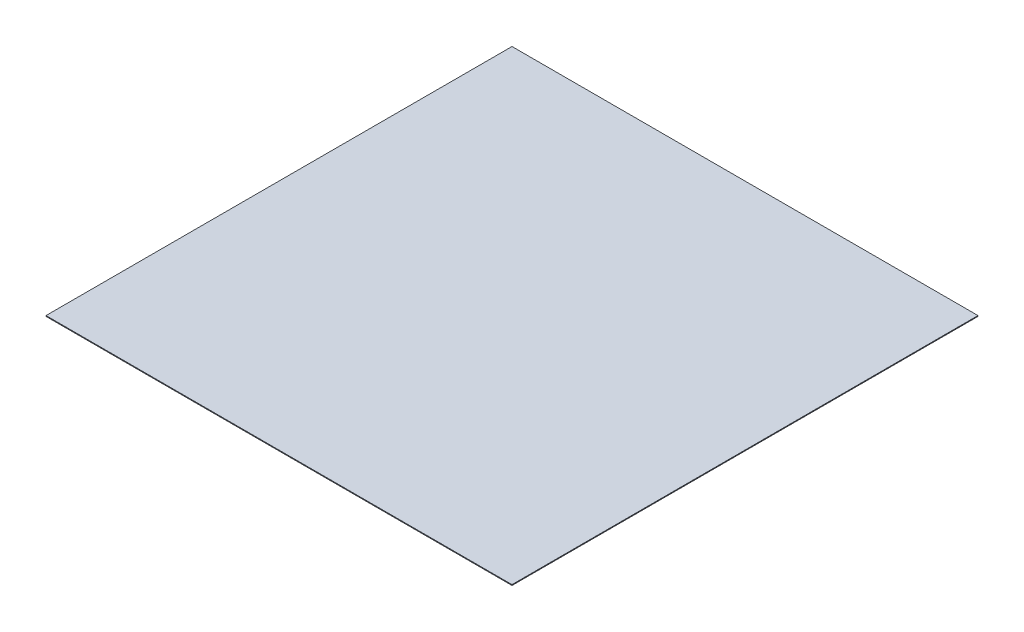
ISO-10303-21;
HEADER;
FILE_DESCRIPTION(('STEP AP214'),'2;1');
FILE_NAME('part.step','',(''),(''),'','','');
FILE_SCHEMA(('AUTOMOTIVE_DESIGN { 1 0 10303 214 1 1 1 1 }'));
ENDSEC;
DATA;
#1=APPLICATION_CONTEXT('core data for automotive mechanical design processes');
#2=APPLICATION_PROTOCOL_DEFINITION('international standard','automotive_design',2000,#1);
#3=PRODUCT_CONTEXT('',#1,'mechanical');
#4=PRODUCT('Part','Part','',(#3));
#5=PRODUCT_RELATED_PRODUCT_CATEGORY('part','',(#4));
#6=PRODUCT_DEFINITION_FORMATION('','',#4);
#7=PRODUCT_DEFINITION_CONTEXT('part definition',#1,'design');
#8=PRODUCT_DEFINITION('design','',#6,#7);
#9=PRODUCT_DEFINITION_SHAPE('','',#8);
#10=(LENGTH_UNIT() NAMED_UNIT(*) SI_UNIT(.MILLI.,.METRE.));
#11=(NAMED_UNIT(*) PLANE_ANGLE_UNIT() SI_UNIT($,.RADIAN.));
#12=(NAMED_UNIT(*) SI_UNIT($,.STERADIAN.) SOLID_ANGLE_UNIT());
#13=UNCERTAINTY_MEASURE_WITH_UNIT(LENGTH_MEASURE(1.E-05),#10,'distance_accuracy_value','');
#14=(GEOMETRIC_REPRESENTATION_CONTEXT(3) GLOBAL_UNCERTAINTY_ASSIGNED_CONTEXT((#13)) GLOBAL_UNIT_ASSIGNED_CONTEXT((#10,
#11,#12)) REPRESENTATION_CONTEXT('',''));
#15=CARTESIAN_POINT('',(0.,0.,0.));
#16=DIRECTION('',(0.,0.,1.));
#17=DIRECTION('',(1.,0.,0.));
#18=AXIS2_PLACEMENT_3D('',#15,#16,#17);
#19=CARTESIAN_POINT('',(0.,2.54,0.));
#20=DIRECTION('',(1.,0.,0.));
#21=DIRECTION('',(0.,0.,-1.));
#22=AXIS2_PLACEMENT_3D('',#19,#20,#21);
#23=PLANE('',#22);
#24=DIRECTION('',(0.,0.,1.));
#25=VECTOR('',#24,1.);
#26=CARTESIAN_POINT('',(0.,0.,0.));
#27=LINE('',#26,#25);
#28=CARTESIAN_POINT('',(0.,0.,-1524.));
#29=VERTEX_POINT('',#28);
#30=CARTESIAN_POINT('',(0.,0.,0.));
#31=VERTEX_POINT('',#30);
#32=EDGE_CURVE('E102',#29,#31,#27,.T.);
#33=ORIENTED_EDGE('',*,*,#32,.T.);
#34=DIRECTION('',(0.,-1.,0.));
#35=VECTOR('',#34,1.);
#36=CARTESIAN_POINT('',(0.,2.54,0.));
#37=LINE('',#36,#35);
#38=CARTESIAN_POINT('',(0.,2.54,0.));
#39=VERTEX_POINT('',#38);
#40=EDGE_CURVE('E11',#39,#31,#37,.T.);
#41=ORIENTED_EDGE('',*,*,#40,.F.);
#42=DIRECTION('',(0.,0.,1.));
#43=VECTOR('',#42,1.);
#44=CARTESIAN_POINT('',(0.,2.54,0.));
#45=LINE('',#44,#43);
#46=CARTESIAN_POINT('',(0.,2.54,-1524.));
#47=VERTEX_POINT('',#46);
#48=EDGE_CURVE('E87',#47,#39,#45,.T.);
#49=ORIENTED_EDGE('',*,*,#48,.F.);
#50=DIRECTION('',(0.,-1.,0.));
#51=VECTOR('',#50,1.);
#52=CARTESIAN_POINT('',(0.,2.54,-1524.));
#53=LINE('',#52,#51);
#54=EDGE_CURVE('E98',#47,#29,#53,.T.);
#55=ORIENTED_EDGE('',*,*,#54,.T.);
#56=EDGE_LOOP('',(#33,#41,#49,#55));
#57=FACE_BOUND('',#56,.T.);
#58=ADVANCED_FACE('F36',(#57),#23,.F.);
#59=CARTESIAN_POINT('',(0.,2.54,0.));
#60=DIRECTION('',(0.,0.,-1.));
#61=DIRECTION('',(-1.,0.,0.));
#62=AXIS2_PLACEMENT_3D('',#59,#60,#61);
#63=PLANE('',#62);
#64=DIRECTION('',(1.,0.,0.));
#65=VECTOR('',#64,1.);
#66=CARTESIAN_POINT('',(0.,0.,0.));
#67=LINE('',#66,#65);
#68=CARTESIAN_POINT('',(1524.,0.,0.));
#69=VERTEX_POINT('',#68);
#70=EDGE_CURVE('E91',#31,#69,#67,.T.);
#71=ORIENTED_EDGE('',*,*,#70,.T.);
#72=DIRECTION('',(0.,-1.,0.));
#73=VECTOR('',#72,1.);
#74=CARTESIAN_POINT('',(1524.,2.54,0.));
#75=LINE('',#74,#73);
#76=CARTESIAN_POINT('',(1524.,2.54,0.));
#77=VERTEX_POINT('',#76);
#78=EDGE_CURVE('E44',#77,#69,#75,.T.);
#79=ORIENTED_EDGE('',*,*,#78,.F.);
#80=DIRECTION('',(1.,0.,0.));
#81=VECTOR('',#80,1.);
#82=CARTESIAN_POINT('',(0.,2.54,0.));
#83=LINE('',#82,#81);
#84=EDGE_CURVE('E82',#39,#77,#83,.T.);
#85=ORIENTED_EDGE('',*,*,#84,.F.);
#86=ORIENTED_EDGE('',*,*,#40,.T.);
#87=EDGE_LOOP('',(#71,#79,#85,#86));
#88=FACE_BOUND('',#87,.T.);
#89=ADVANCED_FACE('F90',(#88),#63,.F.);
#90=CARTESIAN_POINT('',(1524.,2.54,0.));
#91=DIRECTION('',(-1.,0.,0.));
#92=DIRECTION('',(0.,0.,1.));
#93=AXIS2_PLACEMENT_3D('',#90,#91,#92);
#94=PLANE('',#93);
#95=DIRECTION('',(0.,0.,-1.));
#96=VECTOR('',#95,1.);
#97=CARTESIAN_POINT('',(1524.,0.,0.));
#98=LINE('',#97,#96);
#99=CARTESIAN_POINT('',(1524.,0.,-1524.));
#100=VERTEX_POINT('',#99);
#101=EDGE_CURVE('E69',#69,#100,#98,.T.);
#102=ORIENTED_EDGE('',*,*,#101,.T.);
#103=DIRECTION('',(0.,-1.,0.));
#104=VECTOR('',#103,1.);
#105=CARTESIAN_POINT('',(1524.,2.54,-1524.));
#106=LINE('',#105,#104);
#107=CARTESIAN_POINT('',(1524.,2.54,-1524.));
#108=VERTEX_POINT('',#107);
#109=EDGE_CURVE('E92',#108,#100,#106,.T.);
#110=ORIENTED_EDGE('',*,*,#109,.F.);
#111=DIRECTION('',(0.,0.,-1.));
#112=VECTOR('',#111,1.);
#113=CARTESIAN_POINT('',(1524.,2.54,0.));
#114=LINE('',#113,#112);
#115=EDGE_CURVE('E85',#77,#108,#114,.T.);
#116=ORIENTED_EDGE('',*,*,#115,.F.);
#117=ORIENTED_EDGE('',*,*,#78,.T.);
#118=EDGE_LOOP('',(#102,#110,#116,#117));
#119=FACE_BOUND('',#118,.T.);
#120=ADVANCED_FACE('F93',(#119),#94,.F.);
#121=CARTESIAN_POINT('',(0.,2.54,-1524.));
#122=DIRECTION('',(0.,0.,1.));
#123=DIRECTION('',(1.,0.,0.));
#124=AXIS2_PLACEMENT_3D('',#121,#122,#123);
#125=PLANE('',#124);
#126=DIRECTION('',(-1.,0.,0.));
#127=VECTOR('',#126,1.);
#128=CARTESIAN_POINT('',(0.,0.,-1524.));
#129=LINE('',#128,#127);
#130=EDGE_CURVE('E75',#100,#29,#129,.T.);
#131=ORIENTED_EDGE('',*,*,#130,.T.);
#132=ORIENTED_EDGE('',*,*,#54,.F.);
#133=DIRECTION('',(-1.,0.,0.));
#134=VECTOR('',#133,1.);
#135=CARTESIAN_POINT('',(0.,2.54,-1524.));
#136=LINE('',#135,#134);
#137=EDGE_CURVE('E52',#108,#47,#136,.T.);
#138=ORIENTED_EDGE('',*,*,#137,.F.);
#139=ORIENTED_EDGE('',*,*,#109,.T.);
#140=EDGE_LOOP('',(#131,#132,#138,#139));
#141=FACE_BOUND('',#140,.T.);
#142=ADVANCED_FACE('F111',(#141),#125,.F.);
#143=CARTESIAN_POINT('',(0.,2.54,0.));
#144=DIRECTION('',(0.,-1.,0.));
#145=DIRECTION('',(0.,0.,-1.));
#146=AXIS2_PLACEMENT_3D('',#143,#144,#145);
#147=PLANE('',#146);
#148=ORIENTED_EDGE('',*,*,#48,.T.);
#149=ORIENTED_EDGE('',*,*,#84,.T.);
#150=ORIENTED_EDGE('',*,*,#115,.T.);
#151=ORIENTED_EDGE('',*,*,#137,.T.);
#152=EDGE_LOOP('',(#148,#149,#150,#151));
#153=FACE_BOUND('',#152,.T.);
#154=ADVANCED_FACE('F83',(#153),#147,.F.);
#155=CARTESIAN_POINT('',(0.,0.,0.));
#156=DIRECTION('',(0.,-1.,0.));
#157=DIRECTION('',(0.,0.,-1.));
#158=AXIS2_PLACEMENT_3D('',#155,#156,#157);
#159=PLANE('',#158);
#160=ORIENTED_EDGE('',*,*,#32,.F.);
#161=ORIENTED_EDGE('',*,*,#130,.F.);
#162=ORIENTED_EDGE('',*,*,#101,.F.);
#163=ORIENTED_EDGE('',*,*,#70,.F.);
#164=EDGE_LOOP('',(#160,#161,#162,#163));
#165=FACE_BOUND('',#164,.T.);
#166=ADVANCED_FACE('F114',(#165),#159,.T.);
#167=CLOSED_SHELL('',(#58,#89,#120,#142,#154,#166));
#168=MANIFOLD_SOLID_BREP('B2',#167);
#169=ADVANCED_BREP_SHAPE_REPRESENTATION('',(#18,#168),#14);
#170=SHAPE_DEFINITION_REPRESENTATION(#9,#169);
ENDSEC;
END-ISO-10303-21;
